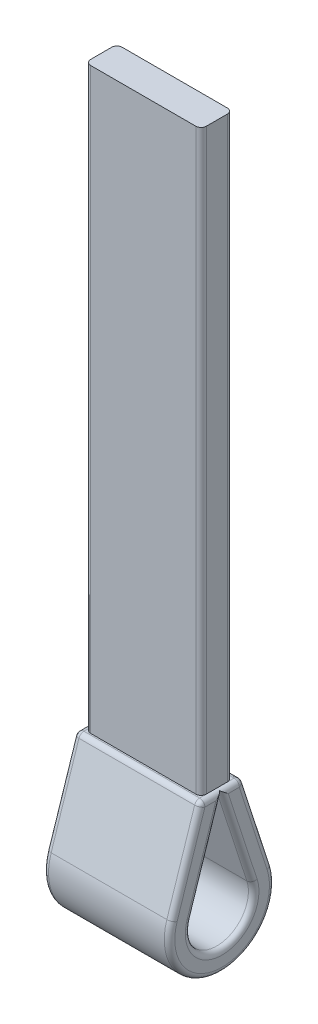
ISO-10303-21;
HEADER;
FILE_DESCRIPTION(('STEP AP214'),'2;1');
FILE_NAME('part.step','',(''),(''),'','','');
FILE_SCHEMA(('AUTOMOTIVE_DESIGN { 1 0 10303 214 1 1 1 1 }'));
ENDSEC;
DATA;
#1=APPLICATION_CONTEXT('core data for automotive mechanical design processes');
#2=APPLICATION_PROTOCOL_DEFINITION('international standard','automotive_design',2000,#1);
#3=PRODUCT_CONTEXT('',#1,'mechanical');
#4=PRODUCT('Part','Part','',(#3));
#5=PRODUCT_RELATED_PRODUCT_CATEGORY('part','',(#4));
#6=PRODUCT_DEFINITION_FORMATION('','',#4);
#7=PRODUCT_DEFINITION_CONTEXT('part definition',#1,'design');
#8=PRODUCT_DEFINITION('design','',#6,#7);
#9=PRODUCT_DEFINITION_SHAPE('','',#8);
#10=(LENGTH_UNIT() NAMED_UNIT(*) SI_UNIT(.MILLI.,.METRE.));
#11=(NAMED_UNIT(*) PLANE_ANGLE_UNIT() SI_UNIT($,.RADIAN.));
#12=(NAMED_UNIT(*) SI_UNIT($,.STERADIAN.) SOLID_ANGLE_UNIT());
#13=UNCERTAINTY_MEASURE_WITH_UNIT(LENGTH_MEASURE(1.E-05),#10,'distance_accuracy_value','');
#14=(GEOMETRIC_REPRESENTATION_CONTEXT(3) GLOBAL_UNCERTAINTY_ASSIGNED_CONTEXT((#13)) GLOBAL_UNIT_ASSIGNED_CONTEXT((#10,
#11,#12)) REPRESENTATION_CONTEXT('',''));
#15=CARTESIAN_POINT('',(0.,0.,0.));
#16=DIRECTION('',(0.,0.,1.));
#17=DIRECTION('',(1.,0.,0.));
#18=AXIS2_PLACEMENT_3D('',#15,#16,#17);
#19=CARTESIAN_POINT('',(0.,20.,0.));
#20=DIRECTION('',(0.,1.,0.));
#21=DIRECTION('',(0.,0.,1.));
#22=AXIS2_PLACEMENT_3D('',#19,#20,#21);
#23=PLANE('',#22);
#24=DIRECTION('',(-1.,0.,0.));
#25=VECTOR('',#24,1.);
#26=CARTESIAN_POINT('',(23.,20.,-3.));
#27=LINE('',#26,#25);
#28=CARTESIAN_POINT('',(22.,20.,-3.));
#29=VERTEX_POINT('',#28);
#30=CARTESIAN_POINT('',(2.,20.,-3.));
#31=VERTEX_POINT('',#30);
#32=EDGE_CURVE('E249',#29,#31,#27,.T.);
#33=ORIENTED_EDGE('',*,*,#32,.F.);
#34=CARTESIAN_POINT('',(22.,20.,-2.));
#35=DIRECTION('',(0.,1.,0.));
#36=DIRECTION('',(0.,0.,1.));
#37=AXIS2_PLACEMENT_3D('',#34,#35,#36);
#38=CIRCLE('',#37,1.);
#39=CARTESIAN_POINT('',(23.,20.,-2.));
#40=VERTEX_POINT('',#39);
#41=EDGE_CURVE('E47',#29,#40,#38,.F.);
#42=ORIENTED_EDGE('',*,*,#41,.T.);
#43=DIRECTION('',(0.,0.,-1.));
#44=VECTOR('',#43,1.);
#45=CARTESIAN_POINT('',(23.,20.,0.));
#46=LINE('',#45,#44);
#47=CARTESIAN_POINT('',(23.,20.,-3.27412037217896));
#48=VERTEX_POINT('',#47);
#49=EDGE_CURVE('E54',#40,#48,#46,.T.);
#50=ORIENTED_EDGE('',*,*,#49,.T.);
#51=DIRECTION('',(-1.,0.,0.));
#52=VECTOR('',#51,1.);
#53=CARTESIAN_POINT('',(0.,20.,-3.27412037217896));
#54=LINE('',#53,#52);
#55=CARTESIAN_POINT('',(1.,20.,-3.27412037217896));
#56=VERTEX_POINT('',#55);
#57=EDGE_CURVE('E343',#48,#56,#54,.T.);
#58=ORIENTED_EDGE('',*,*,#57,.T.);
#59=DIRECTION('',(0.,0.,1.));
#60=VECTOR('',#59,1.);
#61=CARTESIAN_POINT('',(1.,20.,4.));
#62=LINE('',#61,#60);
#63=CARTESIAN_POINT('',(1.,20.,-2.));
#64=VERTEX_POINT('',#63);
#65=EDGE_CURVE('E341',#56,#64,#62,.T.);
#66=ORIENTED_EDGE('',*,*,#65,.T.);
#67=CARTESIAN_POINT('',(2.,20.,-2.));
#68=DIRECTION('',(0.,1.,0.));
#69=DIRECTION('',(0.,0.,1.));
#70=AXIS2_PLACEMENT_3D('',#67,#68,#69);
#71=CIRCLE('',#70,1.);
#72=EDGE_CURVE('E435',#64,#31,#71,.F.);
#73=ORIENTED_EDGE('',*,*,#72,.T.);
#74=EDGE_LOOP('',(#33,#42,#50,#58,#66,#73));
#75=FACE_BOUND('',#74,.T.);
#76=ADVANCED_FACE('F38',(#75),#23,.T.);
#77=CARTESIAN_POINT('',(24.,0.,0.));
#78=DIRECTION('',(1.,0.,0.));
#79=DIRECTION('',(0.,0.,-1.));
#80=AXIS2_PLACEMENT_3D('',#77,#78,#79);
#81=PLANE('',#80);
#82=DIRECTION('',(0.,0.950787924741884,0.309842415051623));
#83=VECTOR('',#82,1.);
#84=CARTESIAN_POINT('',(24.,19.6901575849484,-3.04921207525812));
#85=LINE('',#84,#83);
#86=CARTESIAN_POINT('',(24.,2.78858173546461,-8.55709132267695));
#87=VERTEX_POINT('',#86);
#88=CARTESIAN_POINT('',(24.,19.,-3.27412037217896));
#89=VERTEX_POINT('',#88);
#90=EDGE_CURVE('E288',#87,#89,#85,.T.);
#91=ORIENTED_EDGE('',*,*,#90,.T.);
#92=DIRECTION('',(0.,0.,-1.));
#93=VECTOR('',#92,1.);
#94=CARTESIAN_POINT('',(24.,19.,0.));
#95=LINE('',#94,#93);
#96=CARTESIAN_POINT('',(24.,19.,-1.17060186089481));
#97=VERTEX_POINT('',#96);
#98=EDGE_CURVE('E295',#89,#97,#95,.F.);
#99=ORIENTED_EDGE('',*,*,#98,.T.);
#100=DIRECTION('',(0.,0.950787924741884,0.309842415051623));
#101=VECTOR('',#100,1.);
#102=CARTESIAN_POINT('',(24.,2.16889690536136,-6.65551547319318));
#103=LINE('',#102,#101);
#104=CARTESIAN_POINT('',(24.,2.16889690536136,-6.65551547319319));
#105=VERTEX_POINT('',#104);
#106=EDGE_CURVE('E292',#97,#105,#103,.F.);
#107=ORIENTED_EDGE('',*,*,#106,.T.);
#108=CARTESIAN_POINT('',(24.,0.,0.));
#109=DIRECTION('',(1.,0.,0.));
#110=DIRECTION('',(0.,0.,-1.));
#111=AXIS2_PLACEMENT_3D('',#108,#109,#110);
#112=CIRCLE('',#111,7.);
#113=CARTESIAN_POINT('',(24.,2.16889690536136,6.65551547319318));
#114=VERTEX_POINT('',#113);
#115=EDGE_CURVE('E290',#105,#114,#112,.F.);
#116=ORIENTED_EDGE('',*,*,#115,.T.);
#117=DIRECTION('',(0.,-0.950787924741884,0.309842415051623));
#118=VECTOR('',#117,1.);
#119=CARTESIAN_POINT('',(24.,2.16889690536136,6.65551547319318));
#120=LINE('',#119,#118);
#121=CARTESIAN_POINT('',(24.,19.,1.17060186089481));
#122=VERTEX_POINT('',#121);
#123=EDGE_CURVE('E284',#114,#122,#120,.F.);
#124=ORIENTED_EDGE('',*,*,#123,.T.);
#125=DIRECTION('',(0.,0.,-1.));
#126=VECTOR('',#125,1.);
#127=CARTESIAN_POINT('',(24.,19.,0.));
#128=LINE('',#127,#126);
#129=CARTESIAN_POINT('',(24.,19.,3.27412037217896));
#130=VERTEX_POINT('',#129);
#131=EDGE_CURVE('E282',#122,#130,#128,.F.);
#132=ORIENTED_EDGE('',*,*,#131,.T.);
#133=DIRECTION('',(0.,-0.950787924741884,0.309842415051623));
#134=VECTOR('',#133,1.);
#135=CARTESIAN_POINT('',(24.,2.78858173546461,8.55709132267695));
#136=LINE('',#135,#134);
#137=CARTESIAN_POINT('',(24.,2.78858173546461,8.55709132267695));
#138=VERTEX_POINT('',#137);
#139=EDGE_CURVE('E280',#130,#138,#136,.T.);
#140=ORIENTED_EDGE('',*,*,#139,.T.);
#141=CARTESIAN_POINT('',(24.,0.,0.));
#142=DIRECTION('',(1.,0.,0.));
#143=DIRECTION('',(0.,0.,-1.));
#144=AXIS2_PLACEMENT_3D('',#141,#142,#143);
#145=CIRCLE('',#144,9.);
#146=EDGE_CURVE('E286',#138,#87,#145,.T.);
#147=ORIENTED_EDGE('',*,*,#146,.T.);
#148=EDGE_LOOP('',(#91,#99,#107,#116,#124,#132,#140,#147));
#149=FACE_BOUND('',#148,.T.);
#150=ADVANCED_FACE('F489',(#149),#81,.T.);
#151=CARTESIAN_POINT('',(0.,0.,0.));
#152=DIRECTION('',(1.,0.,0.));
#153=DIRECTION('',(0.,0.,-1.));
#154=AXIS2_PLACEMENT_3D('',#151,#152,#153);
#155=PLANE('',#154);
#156=DIRECTION('',(0.,-0.950787924741884,0.309842415051623));
#157=VECTOR('',#156,1.);
#158=CARTESIAN_POINT('',(0.,2.16889690536136,6.65551547319318));
#159=LINE('',#158,#157);
#160=CARTESIAN_POINT('',(0.,19.,1.17060186089481));
#161=VERTEX_POINT('',#160);
#162=CARTESIAN_POINT('',(0.,2.16889690536136,6.65551547319318));
#163=VERTEX_POINT('',#162);
#164=EDGE_CURVE('E320',#161,#163,#159,.T.);
#165=ORIENTED_EDGE('',*,*,#164,.T.);
#166=CARTESIAN_POINT('',(0.,0.,0.));
#167=DIRECTION('',(1.,0.,0.));
#168=DIRECTION('',(0.,0.,-1.));
#169=AXIS2_PLACEMENT_3D('',#166,#167,#168);
#170=CIRCLE('',#169,7.);
#171=CARTESIAN_POINT('',(0.,2.16889690536136,-6.65551547319318));
#172=VERTEX_POINT('',#171);
#173=EDGE_CURVE('E327',#163,#172,#170,.T.);
#174=ORIENTED_EDGE('',*,*,#173,.T.);
#175=DIRECTION('',(0.,0.950787924741884,0.309842415051623));
#176=VECTOR('',#175,1.);
#177=CARTESIAN_POINT('',(0.,19.674524939232,-0.950787924741884));
#178=LINE('',#177,#176);
#179=CARTESIAN_POINT('',(0.,19.,-1.17060186089481));
#180=VERTEX_POINT('',#179);
#181=EDGE_CURVE('E325',#172,#180,#178,.T.);
#182=ORIENTED_EDGE('',*,*,#181,.T.);
#183=DIRECTION('',(0.,0.,1.));
#184=VECTOR('',#183,1.);
#185=CARTESIAN_POINT('',(0.,19.,-4.));
#186=LINE('',#185,#184);
#187=CARTESIAN_POINT('',(0.,19.,-3.27412037217896));
#188=VERTEX_POINT('',#187);
#189=EDGE_CURVE('E323',#180,#188,#186,.F.);
#190=ORIENTED_EDGE('',*,*,#189,.T.);
#191=DIRECTION('',(0.,0.950787924741884,0.309842415051623));
#192=VECTOR('',#191,1.);
#193=CARTESIAN_POINT('',(0.,2.78858173546461,-8.55709132267695));
#194=LINE('',#193,#192);
#195=CARTESIAN_POINT('',(0.,2.78858173546461,-8.55709132267695));
#196=VERTEX_POINT('',#195);
#197=EDGE_CURVE('E318',#188,#196,#194,.F.);
#198=ORIENTED_EDGE('',*,*,#197,.T.);
#199=CARTESIAN_POINT('',(0.,0.,0.));
#200=DIRECTION('',(1.,0.,0.));
#201=DIRECTION('',(0.,0.,-1.));
#202=AXIS2_PLACEMENT_3D('',#199,#200,#201);
#203=CIRCLE('',#202,9.);
#204=CARTESIAN_POINT('',(0.,2.78858173546461,8.55709132267695));
#205=VERTEX_POINT('',#204);
#206=EDGE_CURVE('E316',#196,#205,#203,.F.);
#207=ORIENTED_EDGE('',*,*,#206,.T.);
#208=DIRECTION('',(0.,-0.950787924741884,0.309842415051623));
#209=VECTOR('',#208,1.);
#210=CARTESIAN_POINT('',(0.,2.78858173546461,8.55709132267695));
#211=LINE('',#210,#209);
#212=CARTESIAN_POINT('',(0.,19.,3.27412037217896));
#213=VERTEX_POINT('',#212);
#214=EDGE_CURVE('E312',#205,#213,#211,.F.);
#215=ORIENTED_EDGE('',*,*,#214,.T.);
#216=DIRECTION('',(0.,0.,1.));
#217=VECTOR('',#216,1.);
#218=CARTESIAN_POINT('',(0.,19.,-4.));
#219=LINE('',#218,#217);
#220=EDGE_CURVE('E314',#213,#161,#219,.F.);
#221=ORIENTED_EDGE('',*,*,#220,.T.);
#222=EDGE_LOOP('',(#165,#174,#182,#190,#198,#207,#215,#221));
#223=FACE_BOUND('',#222,.T.);
#224=ADVANCED_FACE('F550',(#223),#155,.F.);
#225=CARTESIAN_POINT('',(24.,0.,0.));
#226=DIRECTION('',(-1.,0.,0.));
#227=DIRECTION('',(0.,0.,1.));
#228=AXIS2_PLACEMENT_3D('',#225,#226,#227);
#229=CYLINDRICAL_SURFACE('',#228,10.);
#230=DIRECTION('',(-1.,0.,0.));
#231=VECTOR('',#230,1.);
#232=CARTESIAN_POINT('',(24.,3.09842415051623,-9.50787924741883));
#233=LINE('',#232,#231);
#234=CARTESIAN_POINT('',(23.,3.09842415051623,-9.50787924741883));
#235=VERTEX_POINT('',#234);
#236=CARTESIAN_POINT('',(1.,3.09842415051623,-9.50787924741883));
#237=VERTEX_POINT('',#236);
#238=EDGE_CURVE('E272',#235,#237,#233,.T.);
#239=ORIENTED_EDGE('',*,*,#238,.F.);
#240=CARTESIAN_POINT('',(23.,0.,0.));
#241=DIRECTION('',(1.,0.,0.));
#242=DIRECTION('',(0.,0.,-1.));
#243=AXIS2_PLACEMENT_3D('',#240,#241,#242);
#244=CIRCLE('',#243,10.);
#245=CARTESIAN_POINT('',(23.,3.09842415051623,9.50787924741883));
#246=VERTEX_POINT('',#245);
#247=EDGE_CURVE('E310',#235,#246,#244,.F.);
#248=ORIENTED_EDGE('',*,*,#247,.T.);
#249=DIRECTION('',(-1.,0.,0.));
#250=VECTOR('',#249,1.);
#251=CARTESIAN_POINT('',(24.,3.09842415051623,9.50787924741883));
#252=LINE('',#251,#250);
#253=CARTESIAN_POINT('',(1.,3.09842415051623,9.50787924741883));
#254=VERTEX_POINT('',#253);
#255=EDGE_CURVE('E269',#246,#254,#252,.T.);
#256=ORIENTED_EDGE('',*,*,#255,.T.);
#257=CARTESIAN_POINT('',(1.,0.,0.));
#258=DIRECTION('',(1.,0.,0.));
#259=DIRECTION('',(0.,0.,-1.));
#260=AXIS2_PLACEMENT_3D('',#257,#258,#259);
#261=CIRCLE('',#260,10.);
#262=EDGE_CURVE('E308',#254,#237,#261,.T.);
#263=ORIENTED_EDGE('',*,*,#262,.T.);
#264=EDGE_LOOP('',(#239,#248,#256,#263));
#265=FACE_BOUND('',#264,.T.);
#266=ADVANCED_FACE('F573',(#265),#229,.T.);
#267=CARTESIAN_POINT('',(24.,20.,-4.));
#268=DIRECTION('',(0.,-0.309842415051623,0.950787924741884));
#269=DIRECTION('',(0.,-0.950787924741884,-0.309842415051623));
#270=AXIS2_PLACEMENT_3D('',#267,#268,#269);
#271=PLANE('',#270);
#272=DIRECTION('',(-1.,0.,0.));
#273=VECTOR('',#272,1.);
#274=CARTESIAN_POINT('',(24.,19.3098424150516,-4.22490829692085));
#275=LINE('',#274,#273);
#276=CARTESIAN_POINT('',(1.,19.3098424150516,-4.22490829692085));
#277=VERTEX_POINT('',#276);
#278=CARTESIAN_POINT('',(23.,19.3098424150516,-4.22490829692085));
#279=VERTEX_POINT('',#278);
#280=EDGE_CURVE('E301',#277,#279,#275,.F.);
#281=ORIENTED_EDGE('',*,*,#280,.T.);
#282=DIRECTION('',(0.,0.950787924741884,0.309842415051623));
#283=VECTOR('',#282,1.);
#284=CARTESIAN_POINT('',(23.,3.09842415051623,-9.50787924741883));
#285=LINE('',#284,#283);
#286=EDGE_CURVE('E305',#279,#235,#285,.F.);
#287=ORIENTED_EDGE('',*,*,#286,.T.);
#288=ORIENTED_EDGE('',*,*,#238,.T.);
#289=DIRECTION('',(0.,0.950787924741884,0.309842415051623));
#290=VECTOR('',#289,1.);
#291=CARTESIAN_POINT('',(1.,20.,-4.));
#292=LINE('',#291,#290);
#293=EDGE_CURVE('E303',#237,#277,#292,.T.);
#294=ORIENTED_EDGE('',*,*,#293,.T.);
#295=EDGE_LOOP('',(#281,#287,#288,#294));
#296=FACE_BOUND('',#295,.T.);
#297=ADVANCED_FACE('F575',(#296),#271,.F.);
#298=CARTESIAN_POINT('',(24.,3.09842415051623,9.50787924741883));
#299=DIRECTION('',(0.,-0.309842415051623,-0.950787924741884));
#300=DIRECTION('',(0.,0.950787924741884,-0.309842415051623));
#301=AXIS2_PLACEMENT_3D('',#298,#299,#300);
#302=PLANE('',#301);
#303=ORIENTED_EDGE('',*,*,#255,.F.);
#304=DIRECTION('',(0.,-0.950787924741884,0.309842415051623));
#305=VECTOR('',#304,1.);
#306=CARTESIAN_POINT('',(23.,20.,4.));
#307=LINE('',#306,#305);
#308=CARTESIAN_POINT('',(23.,19.3098424150516,4.22490829692084));
#309=VERTEX_POINT('',#308);
#310=EDGE_CURVE('E217',#246,#309,#307,.F.);
#311=ORIENTED_EDGE('',*,*,#310,.T.);
#312=DIRECTION('',(-1.,0.,0.));
#313=VECTOR('',#312,1.);
#314=CARTESIAN_POINT('',(0.,19.3098424150516,4.22490829692084));
#315=LINE('',#314,#313);
#316=CARTESIAN_POINT('',(1.,19.3098424150516,4.22490829692084));
#317=VERTEX_POINT('',#316);
#318=EDGE_CURVE('E348',#309,#317,#315,.T.);
#319=ORIENTED_EDGE('',*,*,#318,.T.);
#320=DIRECTION('',(0.,-0.950787924741884,0.309842415051623));
#321=VECTOR('',#320,1.);
#322=CARTESIAN_POINT('',(1.,3.09842415051623,9.50787924741883));
#323=LINE('',#322,#321);
#324=EDGE_CURVE('E346',#317,#254,#323,.T.);
#325=ORIENTED_EDGE('',*,*,#324,.T.);
#326=EDGE_LOOP('',(#303,#311,#319,#325));
#327=FACE_BOUND('',#326,.T.);
#328=ADVANCED_FACE('F570',(#327),#302,.F.);
#329=CARTESIAN_POINT('',(24.,0.,0.));
#330=DIRECTION('',(-1.,0.,0.));
#331=DIRECTION('',(0.,0.,1.));
#332=AXIS2_PLACEMENT_3D('',#329,#330,#331);
#333=CYLINDRICAL_SURFACE('',#332,6.);
#334=DIRECTION('',(-1.,0.,0.));
#335=VECTOR('',#334,1.);
#336=CARTESIAN_POINT('',(24.,1.85905449030974,5.7047275484513));
#337=LINE('',#336,#335);
#338=CARTESIAN_POINT('',(23.,1.85905449030974,5.7047275484513));
#339=VERTEX_POINT('',#338);
#340=CARTESIAN_POINT('',(1.,1.85905449030974,5.7047275484513));
#341=VERTEX_POINT('',#340);
#342=EDGE_CURVE('E260',#339,#341,#337,.T.);
#343=ORIENTED_EDGE('',*,*,#342,.F.);
#344=CARTESIAN_POINT('',(23.,0.,0.));
#345=DIRECTION('',(1.,0.,0.));
#346=DIRECTION('',(0.,0.,-1.));
#347=AXIS2_PLACEMENT_3D('',#344,#345,#346);
#348=CIRCLE('',#347,6.);
#349=CARTESIAN_POINT('',(23.,1.85905449030974,-5.7047275484513));
#350=VERTEX_POINT('',#349);
#351=EDGE_CURVE('E299',#339,#350,#348,.T.);
#352=ORIENTED_EDGE('',*,*,#351,.T.);
#353=DIRECTION('',(-1.,0.,0.));
#354=VECTOR('',#353,1.);
#355=CARTESIAN_POINT('',(24.,1.85905449030974,-5.7047275484513));
#356=LINE('',#355,#354);
#357=CARTESIAN_POINT('',(1.,1.85905449030974,-5.7047275484513));
#358=VERTEX_POINT('',#357);
#359=EDGE_CURVE('E266',#350,#358,#356,.T.);
#360=ORIENTED_EDGE('',*,*,#359,.T.);
#361=CARTESIAN_POINT('',(1.,0.,0.));
#362=DIRECTION('',(1.,0.,0.));
#363=DIRECTION('',(0.,0.,-1.));
#364=AXIS2_PLACEMENT_3D('',#361,#362,#363);
#365=CIRCLE('',#364,6.);
#366=EDGE_CURVE('E297',#358,#341,#365,.F.);
#367=ORIENTED_EDGE('',*,*,#366,.T.);
#368=EDGE_LOOP('',(#343,#352,#360,#367));
#369=FACE_BOUND('',#368,.T.);
#370=ADVANCED_FACE('F546',(#369),#333,.F.);
#371=CARTESIAN_POINT('',(24.,19.3646825241803,0.));
#372=DIRECTION('',(0.,-0.309842415051623,0.950787924741883));
#373=DIRECTION('',(0.,-0.950787924741884,-0.309842415051623));
#374=AXIS2_PLACEMENT_3D('',#371,#372,#373);
#375=PLANE('',#374);
#376=ORIENTED_EDGE('',*,*,#359,.F.);
#377=DIRECTION('',(0.,0.950787924741884,0.309842415051623));
#378=VECTOR('',#377,1.);
#379=CARTESIAN_POINT('',(23.,19.3646825241803,0.));
#380=LINE('',#379,#378);
#381=CARTESIAN_POINT('',(23.,19.3646825241803,0.));
#382=VERTEX_POINT('',#381);
#383=EDGE_CURVE('E277',#350,#382,#380,.T.);
#384=ORIENTED_EDGE('',*,*,#383,.T.);
#385=DIRECTION('',(-1.,0.,0.));
#386=VECTOR('',#385,1.);
#387=CARTESIAN_POINT('',(24.,19.3646825241803,0.));
#388=LINE('',#387,#386);
#389=CARTESIAN_POINT('',(1.,19.3646825241803,0.));
#390=VERTEX_POINT('',#389);
#391=EDGE_CURVE('E263',#382,#390,#388,.T.);
#392=ORIENTED_EDGE('',*,*,#391,.T.);
#393=DIRECTION('',(0.,0.950787924741884,0.309842415051623));
#394=VECTOR('',#393,1.);
#395=CARTESIAN_POINT('',(1.,1.85905449030974,-5.7047275484513));
#396=LINE('',#395,#394);
#397=EDGE_CURVE('E275',#390,#358,#396,.F.);
#398=ORIENTED_EDGE('',*,*,#397,.T.);
#399=EDGE_LOOP('',(#376,#384,#392,#398));
#400=FACE_BOUND('',#399,.T.);
#401=ADVANCED_FACE('F528',(#400),#375,.T.);
#402=CARTESIAN_POINT('',(24.,1.85905449030974,5.7047275484513));
#403=DIRECTION('',(0.,-0.309842415051623,-0.950787924741883));
#404=DIRECTION('',(0.,0.950787924741884,-0.309842415051623));
#405=AXIS2_PLACEMENT_3D('',#402,#403,#404);
#406=PLANE('',#405);
#407=ORIENTED_EDGE('',*,*,#342,.T.);
#408=DIRECTION('',(0.,-0.950787924741884,0.309842415051623));
#409=VECTOR('',#408,1.);
#410=CARTESIAN_POINT('',(1.,19.3646825241803,0.));
#411=LINE('',#410,#409);
#412=EDGE_CURVE('E331',#341,#390,#411,.F.);
#413=ORIENTED_EDGE('',*,*,#412,.T.);
#414=ORIENTED_EDGE('',*,*,#391,.F.);
#415=DIRECTION('',(0.,-0.950787924741884,0.309842415051623));
#416=VECTOR('',#415,1.);
#417=CARTESIAN_POINT('',(23.,1.85905449030974,5.7047275484513));
#418=LINE('',#417,#416);
#419=EDGE_CURVE('E329',#382,#339,#418,.T.);
#420=ORIENTED_EDGE('',*,*,#419,.T.);
#421=EDGE_LOOP('',(#407,#413,#414,#420));
#422=FACE_BOUND('',#421,.T.);
#423=ADVANCED_FACE('F529',(#422),#406,.T.);
#424=DIRECTION('',(-1.,0.,0.));
#425=VECTOR('',#424,1.);
#426=CARTESIAN_POINT('',(24.,20.,3.27412037217896));
#427=LINE('',#426,#425);
#428=CARTESIAN_POINT('',(1.,20.,3.27412037217896));
#429=VERTEX_POINT('',#428);
#430=CARTESIAN_POINT('',(23.,20.,3.27412037217896));
#431=VERTEX_POINT('',#430);
#432=EDGE_CURVE('E336',#429,#431,#427,.F.);
#433=ORIENTED_EDGE('',*,*,#432,.T.);
#434=DIRECTION('',(0.,0.,-1.));
#435=VECTOR('',#434,1.);
#436=CARTESIAN_POINT('',(23.,20.,0.));
#437=LINE('',#436,#435);
#438=CARTESIAN_POINT('',(23.,20.,2.));
#439=VERTEX_POINT('',#438);
#440=EDGE_CURVE('E338',#431,#439,#437,.T.);
#441=ORIENTED_EDGE('',*,*,#440,.T.);
#442=CARTESIAN_POINT('',(22.,20.,2.));
#443=DIRECTION('',(0.,1.,0.));
#444=DIRECTION('',(0.,0.,1.));
#445=AXIS2_PLACEMENT_3D('',#442,#443,#444);
#446=CIRCLE('',#445,1.);
#447=CARTESIAN_POINT('',(22.,20.,3.));
#448=VERTEX_POINT('',#447);
#449=EDGE_CURVE('E11',#439,#448,#446,.F.);
#450=ORIENTED_EDGE('',*,*,#449,.T.);
#451=DIRECTION('',(1.,0.,0.));
#452=VECTOR('',#451,1.);
#453=CARTESIAN_POINT('',(1.,20.,3.));
#454=LINE('',#453,#452);
#455=CARTESIAN_POINT('',(2.,20.,3.));
#456=VERTEX_POINT('',#455);
#457=EDGE_CURVE('E255',#456,#448,#454,.T.);
#458=ORIENTED_EDGE('',*,*,#457,.F.);
#459=CARTESIAN_POINT('',(2.,20.,2.));
#460=DIRECTION('',(0.,1.,0.));
#461=DIRECTION('',(0.,0.,1.));
#462=AXIS2_PLACEMENT_3D('',#459,#460,#461);
#463=CIRCLE('',#462,1.);
#464=CARTESIAN_POINT('',(1.,20.,2.));
#465=VERTEX_POINT('',#464);
#466=EDGE_CURVE('E437',#456,#465,#463,.F.);
#467=ORIENTED_EDGE('',*,*,#466,.T.);
#468=DIRECTION('',(0.,0.,1.));
#469=VECTOR('',#468,1.);
#470=CARTESIAN_POINT('',(1.,20.,4.));
#471=LINE('',#470,#469);
#472=EDGE_CURVE('E334',#465,#429,#471,.T.);
#473=ORIENTED_EDGE('',*,*,#472,.T.);
#474=EDGE_LOOP('',(#433,#441,#450,#458,#467,#473));
#475=FACE_BOUND('',#474,.T.);
#476=ADVANCED_FACE('F452',(#475),#23,.T.);
#477=CARTESIAN_POINT('',(23.,20.,-3.));
#478=DIRECTION('',(0.,0.,-1.));
#479=DIRECTION('',(-1.,0.,0.));
#480=AXIS2_PLACEMENT_3D('',#477,#478,#479);
#481=PLANE('',#480);
#482=ORIENTED_EDGE('',*,*,#32,.T.);
#483=DIRECTION('',(0.,1.,0.));
#484=VECTOR('',#483,1.);
#485=CARTESIAN_POINT('',(2.,20.,-3.));
#486=LINE('',#485,#484);
#487=CARTESIAN_POINT('',(2.,130.,-3.));
#488=VERTEX_POINT('',#487);
#489=EDGE_CURVE('E216',#31,#488,#486,.T.);
#490=ORIENTED_EDGE('',*,*,#489,.T.);
#491=DIRECTION('',(-1.,0.,0.));
#492=VECTOR('',#491,1.);
#493=CARTESIAN_POINT('',(22.,130.,-3.));
#494=LINE('',#493,#492);
#495=CARTESIAN_POINT('',(22.,130.,-3.));
#496=VERTEX_POINT('',#495);
#497=EDGE_CURVE('E220',#496,#488,#494,.T.);
#498=ORIENTED_EDGE('',*,*,#497,.F.);
#499=DIRECTION('',(0.,1.,0.));
#500=VECTOR('',#499,1.);
#501=CARTESIAN_POINT('',(22.,20.,-3.));
#502=LINE('',#501,#500);
#503=EDGE_CURVE('E206',#496,#29,#502,.F.);
#504=ORIENTED_EDGE('',*,*,#503,.T.);
#505=EDGE_LOOP('',(#482,#490,#498,#504));
#506=FACE_BOUND('',#505,.T.);
#507=ADVANCED_FACE('F221',(#506),#481,.T.);
#508=CARTESIAN_POINT('',(23.,20.,3.));
#509=DIRECTION('',(1.,0.,0.));
#510=DIRECTION('',(0.,0.,-1.));
#511=AXIS2_PLACEMENT_3D('',#508,#509,#510);
#512=PLANE('',#511);
#513=DIRECTION('',(0.,0.,-1.));
#514=VECTOR('',#513,1.);
#515=CARTESIAN_POINT('',(23.,20.,3.));
#516=LINE('',#515,#514);
#517=EDGE_CURVE('E258',#439,#40,#516,.T.);
#518=ORIENTED_EDGE('',*,*,#517,.T.);
#519=DIRECTION('',(0.,1.,0.));
#520=VECTOR('',#519,1.);
#521=CARTESIAN_POINT('',(23.,20.,-2.));
#522=LINE('',#521,#520);
#523=CARTESIAN_POINT('',(23.,130.,-2.));
#524=VERTEX_POINT('',#523);
#525=EDGE_CURVE('E433',#40,#524,#522,.T.);
#526=ORIENTED_EDGE('',*,*,#525,.T.);
#527=DIRECTION('',(0.,0.,-1.));
#528=VECTOR('',#527,1.);
#529=CARTESIAN_POINT('',(23.,130.,2.));
#530=LINE('',#529,#528);
#531=CARTESIAN_POINT('',(23.,130.,2.));
#532=VERTEX_POINT('',#531);
#533=EDGE_CURVE('E232',#532,#524,#530,.T.);
#534=ORIENTED_EDGE('',*,*,#533,.F.);
#535=DIRECTION('',(0.,1.,0.));
#536=VECTOR('',#535,1.);
#537=CARTESIAN_POINT('',(23.,20.,2.));
#538=LINE('',#537,#536);
#539=EDGE_CURVE('E430',#532,#439,#538,.F.);
#540=ORIENTED_EDGE('',*,*,#539,.T.);
#541=EDGE_LOOP('',(#518,#526,#534,#540));
#542=FACE_BOUND('',#541,.T.);
#543=ADVANCED_FACE('F442',(#542),#512,.T.);
#544=CARTESIAN_POINT('',(1.,20.,3.));
#545=DIRECTION('',(0.,0.,1.));
#546=DIRECTION('',(1.,0.,0.));
#547=AXIS2_PLACEMENT_3D('',#544,#545,#546);
#548=PLANE('',#547);
#549=DIRECTION('',(0.,1.,0.));
#550=VECTOR('',#549,1.);
#551=CARTESIAN_POINT('',(22.,20.,3.));
#552=LINE('',#551,#550);
#553=CARTESIAN_POINT('',(22.,130.,3.));
#554=VERTEX_POINT('',#553);
#555=EDGE_CURVE('E426',#448,#554,#552,.T.);
#556=ORIENTED_EDGE('',*,*,#555,.T.);
#557=DIRECTION('',(1.,0.,0.));
#558=VECTOR('',#557,1.);
#559=CARTESIAN_POINT('',(2.,130.,3.));
#560=LINE('',#559,#558);
#561=CARTESIAN_POINT('',(2.,130.,3.));
#562=VERTEX_POINT('',#561);
#563=EDGE_CURVE('E242',#562,#554,#560,.T.);
#564=ORIENTED_EDGE('',*,*,#563,.F.);
#565=DIRECTION('',(0.,1.,0.));
#566=VECTOR('',#565,1.);
#567=CARTESIAN_POINT('',(2.,20.,3.));
#568=LINE('',#567,#566);
#569=EDGE_CURVE('E428',#562,#456,#568,.F.);
#570=ORIENTED_EDGE('',*,*,#569,.T.);
#571=ORIENTED_EDGE('',*,*,#457,.T.);
#572=EDGE_LOOP('',(#556,#564,#570,#571));
#573=FACE_BOUND('',#572,.T.);
#574=ADVANCED_FACE('F455',(#573),#548,.T.);
#575=CARTESIAN_POINT('',(1.,20.,-3.));
#576=DIRECTION('',(-1.,0.,0.));
#577=DIRECTION('',(0.,0.,1.));
#578=AXIS2_PLACEMENT_3D('',#575,#576,#577);
#579=PLANE('',#578);
#580=DIRECTION('',(0.,1.,0.));
#581=VECTOR('',#580,1.);
#582=CARTESIAN_POINT('',(1.,20.,2.));
#583=LINE('',#582,#581);
#584=CARTESIAN_POINT('',(1.,130.,2.));
#585=VERTEX_POINT('',#584);
#586=EDGE_CURVE('E421',#465,#585,#583,.T.);
#587=ORIENTED_EDGE('',*,*,#586,.T.);
#588=DIRECTION('',(0.,0.,1.));
#589=VECTOR('',#588,1.);
#590=CARTESIAN_POINT('',(1.,130.,-2.));
#591=LINE('',#590,#589);
#592=CARTESIAN_POINT('',(1.,130.,-2.));
#593=VERTEX_POINT('',#592);
#594=EDGE_CURVE('E236',#593,#585,#591,.T.);
#595=ORIENTED_EDGE('',*,*,#594,.F.);
#596=DIRECTION('',(0.,1.,0.));
#597=VECTOR('',#596,1.);
#598=CARTESIAN_POINT('',(1.,20.,-2.));
#599=LINE('',#598,#597);
#600=EDGE_CURVE('E423',#593,#64,#599,.F.);
#601=ORIENTED_EDGE('',*,*,#600,.T.);
#602=DIRECTION('',(0.,0.,1.));
#603=VECTOR('',#602,1.);
#604=CARTESIAN_POINT('',(1.,20.,-3.));
#605=LINE('',#604,#603);
#606=EDGE_CURVE('E251',#64,#465,#605,.T.);
#607=ORIENTED_EDGE('',*,*,#606,.T.);
#608=EDGE_LOOP('',(#587,#595,#601,#607));
#609=FACE_BOUND('',#608,.T.);
#610=ADVANCED_FACE('F463',(#609),#579,.T.);
#611=CARTESIAN_POINT('',(1.,0.,0.));
#612=DIRECTION('',(1.,0.,0.));
#613=DIRECTION('',(0.,0.,-1.));
#614=AXIS2_PLACEMENT_3D('',#611,#612,#613);
#615=TOROIDAL_SURFACE('',#614,7.,1.);
#616=CARTESIAN_POINT('',(1.,2.16889690536136,-6.65551547319319));
#617=DIRECTION('',(0.,0.950787924741884,0.309842415051623));
#618=DIRECTION('',(0.,-0.309842415051623,0.950787924741884));
#619=AXIS2_PLACEMENT_3D('',#616,#617,#618);
#620=CIRCLE('',#619,1.);
#621=EDGE_CURVE('E414',#172,#358,#620,.T.);
#622=ORIENTED_EDGE('',*,*,#621,.F.);
#623=ORIENTED_EDGE('',*,*,#173,.F.);
#624=CARTESIAN_POINT('',(1.,2.16889690536136,6.65551547319318));
#625=DIRECTION('',(0.,0.950787924741884,-0.309842415051623));
#626=DIRECTION('',(0.,0.309842415051623,0.950787924741884));
#627=AXIS2_PLACEMENT_3D('',#624,#625,#626);
#628=CIRCLE('',#627,1.);
#629=EDGE_CURVE('E252',#341,#163,#628,.T.);
#630=ORIENTED_EDGE('',*,*,#629,.F.);
#631=ORIENTED_EDGE('',*,*,#366,.F.);
#632=EDGE_LOOP('',(#622,#623,#630,#631));
#633=FACE_BOUND('',#632,.T.);
#634=ADVANCED_FACE('F548',(#633),#615,.T.);
#635=CARTESIAN_POINT('',(1.,2.16889690536136,6.65551547319318));
#636=DIRECTION('',(0.,0.950787924741884,-0.309842415051623));
#637=DIRECTION('',(0.,0.309842415051623,0.950787924741884));
#638=AXIS2_PLACEMENT_3D('',#635,#636,#637);
#639=CYLINDRICAL_SURFACE('',#638,1.);
#640=CARTESIAN_POINT('',(1.,22.5921296115437,0.));
#641=DIRECTION('',(0.,0.,-1.));
#642=DIRECTION('',(0.,1.,0.));
#643=AXIS2_PLACEMENT_3D('',#640,#641,#642);
#644=ELLIPSE('',#643,3.22744708736339,1.);
#645=CARTESIAN_POINT('',(0.472759403994257,19.8497160431129,0.));
#646=VERTEX_POINT('',#645);
#647=EDGE_CURVE('E417',#390,#646,#644,.T.);
#648=ORIENTED_EDGE('',*,*,#647,.F.);
#649=ORIENTED_EDGE('',*,*,#412,.F.);
#650=ORIENTED_EDGE('',*,*,#629,.T.);
#651=ORIENTED_EDGE('',*,*,#164,.F.);
#652=CARTESIAN_POINT('',(1.,19.,1.17060186089481));
#653=DIRECTION('',(0.,0.809272023194804,0.587434075002624));
#654=DIRECTION('',(0.,0.587434075002624,-0.809272023194804));
#655=AXIS2_PLACEMENT_3D('',#652,#653,#654);
#656=ELLIPSE('',#655,1.70231868145465,1.);
#657=EDGE_CURVE('E408',#646,#161,#656,.T.);
#658=ORIENTED_EDGE('',*,*,#657,.F.);
#659=EDGE_LOOP('',(#648,#649,#650,#651,#658));
#660=FACE_BOUND('',#659,.T.);
#661=ADVANCED_FACE('F534',(#660),#639,.T.);
#662=CARTESIAN_POINT('',(1.,2.16889690536136,-6.65551547319318));
#663=DIRECTION('',(0.,-0.950787924741884,-0.309842415051623));
#664=DIRECTION('',(0.,0.309842415051623,-0.950787924741884));
#665=AXIS2_PLACEMENT_3D('',#662,#663,#664);
#666=CYLINDRICAL_SURFACE('',#665,1.);
#667=ORIENTED_EDGE('',*,*,#397,.F.);
#668=ORIENTED_EDGE('',*,*,#647,.T.);
#669=CARTESIAN_POINT('',(1.,19.,-1.17060186089481));
#670=DIRECTION('',(0.,-0.809272023194804,0.587434075002624));
#671=DIRECTION('',(0.,-0.587434075002624,-0.809272023194804));
#672=AXIS2_PLACEMENT_3D('',#669,#670,#671);
#673=ELLIPSE('',#672,1.70231868145465,1.);
#674=EDGE_CURVE('E405',#180,#646,#673,.F.);
#675=ORIENTED_EDGE('',*,*,#674,.F.);
#676=ORIENTED_EDGE('',*,*,#181,.F.);
#677=ORIENTED_EDGE('',*,*,#621,.T.);
#678=EDGE_LOOP('',(#667,#668,#675,#676,#677));
#679=FACE_BOUND('',#678,.T.);
#680=ADVANCED_FACE('F540',(#679),#666,.T.);
#681=CARTESIAN_POINT('',(1.,0.,0.));
#682=DIRECTION('',(1.,0.,0.));
#683=DIRECTION('',(0.,0.,-1.));
#684=AXIS2_PLACEMENT_3D('',#681,#682,#683);
#685=TOROIDAL_SURFACE('',#684,9.,1.);
#686=CARTESIAN_POINT('',(1.,2.78858173546461,-8.55709132267695));
#687=DIRECTION('',(0.,0.950787924741884,0.309842415051623));
#688=DIRECTION('',(0.,-0.309842415051623,0.950787924741884));
#689=AXIS2_PLACEMENT_3D('',#686,#687,#688);
#690=CIRCLE('',#689,1.);
#691=EDGE_CURVE('E402',#237,#196,#690,.T.);
#692=ORIENTED_EDGE('',*,*,#691,.F.);
#693=ORIENTED_EDGE('',*,*,#262,.F.);
#694=CARTESIAN_POINT('',(1.,2.78858173546461,8.55709132267695));
#695=DIRECTION('',(0.,0.950787924741884,-0.309842415051623));
#696=DIRECTION('',(0.,0.309842415051623,0.950787924741884));
#697=AXIS2_PLACEMENT_3D('',#694,#695,#696);
#698=CIRCLE('',#697,1.);
#699=EDGE_CURVE('E411',#205,#254,#698,.T.);
#700=ORIENTED_EDGE('',*,*,#699,.F.);
#701=ORIENTED_EDGE('',*,*,#206,.F.);
#702=EDGE_LOOP('',(#692,#693,#700,#701));
#703=FACE_BOUND('',#702,.T.);
#704=ADVANCED_FACE('F562',(#703),#685,.T.);
#705=CARTESIAN_POINT('',(1.,2.78858173546461,8.55709132267695));
#706=DIRECTION('',(0.,-0.950787924741884,0.309842415051623));
#707=DIRECTION('',(0.,-0.309842415051623,-0.950787924741884));
#708=AXIS2_PLACEMENT_3D('',#705,#706,#707);
#709=CYLINDRICAL_SURFACE('',#708,1.);
#710=ORIENTED_EDGE('',*,*,#699,.T.);
#711=ORIENTED_EDGE('',*,*,#324,.F.);
#712=CARTESIAN_POINT('',(1.,19.,3.27412037217896));
#713=DIRECTION('',(0.,0.950787924741884,-0.309842415051622));
#714=DIRECTION('',(0.,0.309842415051622,0.950787924741884));
#715=AXIS2_PLACEMENT_3D('',#712,#713,#714);
#716=CIRCLE('',#715,1.);
#717=EDGE_CURVE('E399',#213,#317,#716,.T.);
#718=ORIENTED_EDGE('',*,*,#717,.F.);
#719=ORIENTED_EDGE('',*,*,#214,.F.);
#720=EDGE_LOOP('',(#710,#711,#718,#719));
#721=FACE_BOUND('',#720,.T.);
#722=ADVANCED_FACE('F566',(#721),#709,.T.);
#723=CARTESIAN_POINT('',(1.,19.,0.));
#724=DIRECTION('',(0.,0.,-1.));
#725=DIRECTION('',(-1.,0.,0.));
#726=AXIS2_PLACEMENT_3D('',#723,#724,#725);
#727=CYLINDRICAL_SURFACE('',#726,1.);
#728=ORIENTED_EDGE('',*,*,#657,.T.);
#729=ORIENTED_EDGE('',*,*,#220,.F.);
#730=CARTESIAN_POINT('',(1.,19.,3.27412037217896));
#731=DIRECTION('',(0.,0.,1.));
#732=DIRECTION('',(1.,0.,0.));
#733=AXIS2_PLACEMENT_3D('',#730,#731,#732);
#734=CIRCLE('',#733,1.);
#735=EDGE_CURVE('E396',#429,#213,#734,.T.);
#736=ORIENTED_EDGE('',*,*,#735,.F.);
#737=ORIENTED_EDGE('',*,*,#472,.F.);
#738=ORIENTED_EDGE('',*,*,#606,.F.);
#739=ORIENTED_EDGE('',*,*,#65,.F.);
#740=CARTESIAN_POINT('',(1.,19.,-3.27412037217896));
#741=DIRECTION('',(0.,0.,-1.));
#742=DIRECTION('',(0.,1.,0.));
#743=AXIS2_PLACEMENT_3D('',#740,#741,#742);
#744=CIRCLE('',#743,1.);
#745=EDGE_CURVE('E393',#188,#56,#744,.T.);
#746=ORIENTED_EDGE('',*,*,#745,.F.);
#747=ORIENTED_EDGE('',*,*,#189,.F.);
#748=ORIENTED_EDGE('',*,*,#674,.T.);
#749=EDGE_LOOP('',(#728,#729,#736,#737,#738,#739,#746,#747,#748));
#750=FACE_BOUND('',#749,.T.);
#751=ADVANCED_FACE('F473',(#750),#727,.T.);
#752=CARTESIAN_POINT('',(1.,19.6901575849484,-3.04921207525812));
#753=DIRECTION('',(0.,0.950787924741884,0.309842415051623));
#754=DIRECTION('',(0.,-0.309842415051623,0.950787924741884));
#755=AXIS2_PLACEMENT_3D('',#752,#753,#754);
#756=CYLINDRICAL_SURFACE('',#755,1.);
#757=ORIENTED_EDGE('',*,*,#691,.T.);
#758=ORIENTED_EDGE('',*,*,#197,.F.);
#759=CARTESIAN_POINT('',(1.,19.,-3.27412037217896));
#760=DIRECTION('',(0.,0.950787924741884,0.309842415051623));
#761=DIRECTION('',(0.,-0.309842415051623,0.950787924741884));
#762=AXIS2_PLACEMENT_3D('',#759,#760,#761);
#763=CIRCLE('',#762,1.);
#764=EDGE_CURVE('E390',#277,#188,#763,.T.);
#765=ORIENTED_EDGE('',*,*,#764,.F.);
#766=ORIENTED_EDGE('',*,*,#293,.F.);
#767=EDGE_LOOP('',(#757,#758,#765,#766));
#768=FACE_BOUND('',#767,.T.);
#769=ADVANCED_FACE('F556',(#768),#756,.T.);
#770=CARTESIAN_POINT('',(1.,19.,3.27412037217896));
#771=DIRECTION('',(0.,0.,1.));
#772=DIRECTION('',(1.,0.,0.));
#773=AXIS2_PLACEMENT_3D('',#770,#771,#772);
#774=SPHERICAL_SURFACE('',#773,1.);
#775=ORIENTED_EDGE('',*,*,#735,.T.);
#776=ORIENTED_EDGE('',*,*,#717,.T.);
#777=CARTESIAN_POINT('',(1.,19.,3.27412037217896));
#778=DIRECTION('',(-1.,0.,0.));
#779=DIRECTION('',(0.,-1.,0.));
#780=AXIS2_PLACEMENT_3D('',#777,#778,#779);
#781=CIRCLE('',#780,1.);
#782=EDGE_CURVE('E384',#429,#317,#781,.F.);
#783=ORIENTED_EDGE('',*,*,#782,.F.);
#784=EDGE_LOOP('',(#775,#776,#783));
#785=FACE_BOUND('',#784,.T.);
#786=ADVANCED_FACE('F476',(#785),#774,.T.);
#787=CARTESIAN_POINT('',(1.,19.,-3.27412037217896));
#788=DIRECTION('',(0.,0.,1.));
#789=DIRECTION('',(1.,0.,0.));
#790=AXIS2_PLACEMENT_3D('',#787,#788,#789);
#791=SPHERICAL_SURFACE('',#790,1.);
#792=ORIENTED_EDGE('',*,*,#764,.T.);
#793=ORIENTED_EDGE('',*,*,#745,.T.);
#794=CARTESIAN_POINT('',(1.,19.,-3.27412037217896));
#795=DIRECTION('',(-1.,0.,0.));
#796=DIRECTION('',(0.,0.,1.));
#797=AXIS2_PLACEMENT_3D('',#794,#795,#796);
#798=CIRCLE('',#797,1.);
#799=EDGE_CURVE('E381',#277,#56,#798,.F.);
#800=ORIENTED_EDGE('',*,*,#799,.F.);
#801=EDGE_LOOP('',(#792,#793,#800));
#802=FACE_BOUND('',#801,.T.);
#803=ADVANCED_FACE('F580',(#802),#791,.T.);
#804=CARTESIAN_POINT('',(23.,0.,0.));
#805=DIRECTION('',(1.,0.,0.));
#806=DIRECTION('',(0.,0.,-1.));
#807=AXIS2_PLACEMENT_3D('',#804,#805,#806);
#808=TOROIDAL_SURFACE('',#807,9.,1.);
#809=CARTESIAN_POINT('',(23.,2.78858173546461,-8.55709132267695));
#810=DIRECTION('',(0.,0.950787924741883,0.309842415051624));
#811=DIRECTION('',(0.,-0.309842415051624,0.950787924741884));
#812=AXIS2_PLACEMENT_3D('',#809,#810,#811);
#813=CIRCLE('',#812,1.);
#814=EDGE_CURVE('E379',#87,#235,#813,.T.);
#815=ORIENTED_EDGE('',*,*,#814,.F.);
#816=ORIENTED_EDGE('',*,*,#146,.F.);
#817=CARTESIAN_POINT('',(23.,2.78858173546461,8.55709132267695));
#818=DIRECTION('',(0.,0.950787924741884,-0.309842415051623));
#819=DIRECTION('',(0.,0.309842415051623,0.950787924741884));
#820=AXIS2_PLACEMENT_3D('',#817,#818,#819);
#821=CIRCLE('',#820,1.);
#822=EDGE_CURVE('E387',#246,#138,#821,.T.);
#823=ORIENTED_EDGE('',*,*,#822,.F.);
#824=ORIENTED_EDGE('',*,*,#247,.F.);
#825=EDGE_LOOP('',(#815,#816,#823,#824));
#826=FACE_BOUND('',#825,.T.);
#827=ADVANCED_FACE('F499',(#826),#808,.T.);
#828=CARTESIAN_POINT('',(23.,2.78858173546461,8.55709132267695));
#829=DIRECTION('',(0.,0.950787924741884,-0.309842415051623));
#830=DIRECTION('',(0.,0.309842415051623,0.950787924741884));
#831=AXIS2_PLACEMENT_3D('',#828,#829,#830);
#832=CYLINDRICAL_SURFACE('',#831,1.);
#833=ORIENTED_EDGE('',*,*,#822,.T.);
#834=ORIENTED_EDGE('',*,*,#139,.F.);
#835=CARTESIAN_POINT('',(23.,19.,3.27412037217896));
#836=DIRECTION('',(0.,0.950787924741884,-0.309842415051623));
#837=DIRECTION('',(0.,0.309842415051623,0.950787924741884));
#838=AXIS2_PLACEMENT_3D('',#835,#836,#837);
#839=CIRCLE('',#838,1.);
#840=EDGE_CURVE('E376',#309,#130,#839,.T.);
#841=ORIENTED_EDGE('',*,*,#840,.F.);
#842=ORIENTED_EDGE('',*,*,#310,.F.);
#843=EDGE_LOOP('',(#833,#834,#841,#842));
#844=FACE_BOUND('',#843,.T.);
#845=ADVANCED_FACE('F493',(#844),#832,.T.);
#846=CARTESIAN_POINT('',(24.,19.,3.27412037217896));
#847=DIRECTION('',(1.,0.,0.));
#848=DIRECTION('',(0.,0.,-1.));
#849=AXIS2_PLACEMENT_3D('',#846,#847,#848);
#850=CYLINDRICAL_SURFACE('',#849,1.);
#851=ORIENTED_EDGE('',*,*,#782,.T.);
#852=ORIENTED_EDGE('',*,*,#318,.F.);
#853=CARTESIAN_POINT('',(23.,19.,3.27412037217896));
#854=DIRECTION('',(1.,0.,0.));
#855=DIRECTION('',(0.,0.,-1.));
#856=AXIS2_PLACEMENT_3D('',#853,#854,#855);
#857=CIRCLE('',#856,1.);
#858=EDGE_CURVE('E373',#431,#309,#857,.T.);
#859=ORIENTED_EDGE('',*,*,#858,.F.);
#860=ORIENTED_EDGE('',*,*,#432,.F.);
#861=EDGE_LOOP('',(#851,#852,#859,#860));
#862=FACE_BOUND('',#861,.T.);
#863=ADVANCED_FACE('F479',(#862),#850,.T.);
#864=CARTESIAN_POINT('',(0.,19.,-3.27412037217896));
#865=DIRECTION('',(1.,0.,0.));
#866=DIRECTION('',(0.,0.,-1.));
#867=AXIS2_PLACEMENT_3D('',#864,#865,#866);
#868=CYLINDRICAL_SURFACE('',#867,1.);
#869=ORIENTED_EDGE('',*,*,#799,.T.);
#870=ORIENTED_EDGE('',*,*,#57,.F.);
#871=CARTESIAN_POINT('',(23.,19.,-3.27412037217896));
#872=DIRECTION('',(1.,0.,0.));
#873=DIRECTION('',(0.,0.,-1.));
#874=AXIS2_PLACEMENT_3D('',#871,#872,#873);
#875=CIRCLE('',#874,1.);
#876=EDGE_CURVE('E370',#279,#48,#875,.T.);
#877=ORIENTED_EDGE('',*,*,#876,.F.);
#878=ORIENTED_EDGE('',*,*,#280,.F.);
#879=EDGE_LOOP('',(#869,#870,#877,#878));
#880=FACE_BOUND('',#879,.T.);
#881=ADVANCED_FACE('F578',(#880),#868,.T.);
#882=CARTESIAN_POINT('',(23.,2.78858173546461,-8.55709132267695));
#883=DIRECTION('',(0.,-0.950787924741884,-0.309842415051623));
#884=DIRECTION('',(0.,0.309842415051623,-0.950787924741884));
#885=AXIS2_PLACEMENT_3D('',#882,#883,#884);
#886=CYLINDRICAL_SURFACE('',#885,1.);
#887=ORIENTED_EDGE('',*,*,#814,.T.);
#888=ORIENTED_EDGE('',*,*,#286,.F.);
#889=CARTESIAN_POINT('',(23.,19.,-3.27412037217896));
#890=DIRECTION('',(0.,0.950787924741884,0.309842415051623));
#891=DIRECTION('',(0.,-0.309842415051623,0.950787924741884));
#892=AXIS2_PLACEMENT_3D('',#889,#890,#891);
#893=CIRCLE('',#892,1.);
#894=EDGE_CURVE('E367',#89,#279,#893,.T.);
#895=ORIENTED_EDGE('',*,*,#894,.F.);
#896=ORIENTED_EDGE('',*,*,#90,.F.);
#897=EDGE_LOOP('',(#887,#888,#895,#896));
#898=FACE_BOUND('',#897,.T.);
#899=ADVANCED_FACE('F507',(#898),#886,.T.);
#900=CARTESIAN_POINT('',(23.,19.,3.27412037217896));
#901=DIRECTION('',(0.,0.,1.));
#902=DIRECTION('',(1.,0.,0.));
#903=AXIS2_PLACEMENT_3D('',#900,#901,#902);
#904=SPHERICAL_SURFACE('',#903,1.);
#905=ORIENTED_EDGE('',*,*,#858,.T.);
#906=ORIENTED_EDGE('',*,*,#840,.T.);
#907=CARTESIAN_POINT('',(23.,19.,3.27412037217896));
#908=DIRECTION('',(0.,0.,1.));
#909=DIRECTION('',(0.,-1.,0.));
#910=AXIS2_PLACEMENT_3D('',#907,#908,#909);
#911=CIRCLE('',#910,1.);
#912=EDGE_CURVE('E359',#431,#130,#911,.F.);
#913=ORIENTED_EDGE('',*,*,#912,.F.);
#914=EDGE_LOOP('',(#905,#906,#913));
#915=FACE_BOUND('',#914,.T.);
#916=ADVANCED_FACE('F483',(#915),#904,.T.);
#917=CARTESIAN_POINT('',(23.,19.,-3.27412037217896));
#918=DIRECTION('',(0.,0.,1.));
#919=DIRECTION('',(1.,0.,0.));
#920=AXIS2_PLACEMENT_3D('',#917,#918,#919);
#921=SPHERICAL_SURFACE('',#920,1.);
#922=ORIENTED_EDGE('',*,*,#894,.T.);
#923=ORIENTED_EDGE('',*,*,#876,.T.);
#924=CARTESIAN_POINT('',(23.,19.,-3.27412037217896));
#925=DIRECTION('',(0.,0.,-1.));
#926=DIRECTION('',(-1.,0.,0.));
#927=AXIS2_PLACEMENT_3D('',#924,#925,#926);
#928=CIRCLE('',#927,1.);
#929=EDGE_CURVE('E357',#89,#48,#928,.F.);
#930=ORIENTED_EDGE('',*,*,#929,.F.);
#931=EDGE_LOOP('',(#922,#923,#930));
#932=FACE_BOUND('',#931,.T.);
#933=ADVANCED_FACE('F510',(#932),#921,.T.);
#934=CARTESIAN_POINT('',(23.,0.,0.));
#935=DIRECTION('',(1.,0.,0.));
#936=DIRECTION('',(0.,0.,-1.));
#937=AXIS2_PLACEMENT_3D('',#934,#935,#936);
#938=TOROIDAL_SURFACE('',#937,7.,1.);
#939=CARTESIAN_POINT('',(23.,2.16889690536136,-6.65551547319318));
#940=DIRECTION('',(0.,0.950787924741884,0.309842415051623));
#941=DIRECTION('',(0.,-0.309842415051623,0.950787924741884));
#942=AXIS2_PLACEMENT_3D('',#939,#940,#941);
#943=CIRCLE('',#942,1.);
#944=EDGE_CURVE('E355',#350,#105,#943,.T.);
#945=ORIENTED_EDGE('',*,*,#944,.F.);
#946=ORIENTED_EDGE('',*,*,#351,.F.);
#947=CARTESIAN_POINT('',(23.,2.16889690536136,6.65551547319318));
#948=DIRECTION('',(0.,0.950787924741884,-0.309842415051623));
#949=DIRECTION('',(0.,0.309842415051623,0.950787924741884));
#950=AXIS2_PLACEMENT_3D('',#947,#948,#949);
#951=CIRCLE('',#950,1.);
#952=EDGE_CURVE('E364',#114,#339,#951,.T.);
#953=ORIENTED_EDGE('',*,*,#952,.F.);
#954=ORIENTED_EDGE('',*,*,#115,.F.);
#955=EDGE_LOOP('',(#945,#946,#953,#954));
#956=FACE_BOUND('',#955,.T.);
#957=ADVANCED_FACE('F520',(#956),#938,.T.);
#958=CARTESIAN_POINT('',(23.,2.16889690536136,6.65551547319318));
#959=DIRECTION('',(0.,-0.950787924741884,0.309842415051623));
#960=DIRECTION('',(0.,-0.309842415051623,-0.950787924741884));
#961=AXIS2_PLACEMENT_3D('',#958,#959,#960);
#962=CYLINDRICAL_SURFACE('',#961,1.);
#963=CARTESIAN_POINT('',(23.,19.,1.17060186089481));
#964=DIRECTION('',(0.,-0.809272023194804,-0.587434075002624));
#965=DIRECTION('',(0.,-0.587434075002624,0.809272023194804));
#966=AXIS2_PLACEMENT_3D('',#963,#964,#965);
#967=ELLIPSE('',#966,1.70231868145465,1.);
#968=CARTESIAN_POINT('',(23.5272405960057,19.8497160431129,0.));
#969=VERTEX_POINT('',#968);
#970=EDGE_CURVE('E362',#122,#969,#967,.F.);
#971=ORIENTED_EDGE('',*,*,#970,.F.);
#972=ORIENTED_EDGE('',*,*,#123,.F.);
#973=ORIENTED_EDGE('',*,*,#952,.T.);
#974=ORIENTED_EDGE('',*,*,#419,.F.);
#975=CARTESIAN_POINT('',(23.,22.5921296115437,0.));
#976=DIRECTION('',(0.,0.,1.));
#977=DIRECTION('',(0.,1.,0.));
#978=AXIS2_PLACEMENT_3D('',#975,#976,#977);
#979=ELLIPSE('',#978,3.22744708736339,1.);
#980=EDGE_CURVE('E353',#969,#382,#979,.F.);
#981=ORIENTED_EDGE('',*,*,#980,.F.);
#982=EDGE_LOOP('',(#971,#972,#973,#974,#981));
#983=FACE_BOUND('',#982,.T.);
#984=ADVANCED_FACE('F522',(#983),#962,.T.);
#985=CARTESIAN_POINT('',(23.,19.,0.));
#986=DIRECTION('',(0.,0.,-1.));
#987=DIRECTION('',(-1.,0.,0.));
#988=AXIS2_PLACEMENT_3D('',#985,#986,#987);
#989=CYLINDRICAL_SURFACE('',#988,1.);
#990=ORIENTED_EDGE('',*,*,#131,.F.);
#991=ORIENTED_EDGE('',*,*,#970,.T.);
#992=CARTESIAN_POINT('',(23.,19.,-1.17060186089481));
#993=DIRECTION('',(0.,0.809272023194804,-0.587434075002624));
#994=DIRECTION('',(0.,0.587434075002624,0.809272023194804));
#995=AXIS2_PLACEMENT_3D('',#992,#993,#994);
#996=ELLIPSE('',#995,1.70231868145465,1.);
#997=EDGE_CURVE('E248',#97,#969,#996,.F.);
#998=ORIENTED_EDGE('',*,*,#997,.F.);
#999=ORIENTED_EDGE('',*,*,#98,.F.);
#1000=ORIENTED_EDGE('',*,*,#929,.T.);
#1001=ORIENTED_EDGE('',*,*,#49,.F.);
#1002=ORIENTED_EDGE('',*,*,#517,.F.);
#1003=ORIENTED_EDGE('',*,*,#440,.F.);
#1004=ORIENTED_EDGE('',*,*,#912,.T.);
#1005=EDGE_LOOP('',(#990,#991,#998,#999,#1000,#1001,#1002,#1003,#1004));
#1006=FACE_BOUND('',#1005,.T.);
#1007=ADVANCED_FACE('F446',(#1006),#989,.T.);
#1008=CARTESIAN_POINT('',(23.,19.674524939232,-0.950787924741883));
#1009=DIRECTION('',(0.,0.950787924741884,0.309842415051623));
#1010=DIRECTION('',(0.,-0.309842415051623,0.950787924741884));
#1011=AXIS2_PLACEMENT_3D('',#1008,#1009,#1010);
#1012=CYLINDRICAL_SURFACE('',#1011,1.);
#1013=ORIENTED_EDGE('',*,*,#944,.T.);
#1014=ORIENTED_EDGE('',*,*,#106,.F.);
#1015=ORIENTED_EDGE('',*,*,#997,.T.);
#1016=ORIENTED_EDGE('',*,*,#980,.T.);
#1017=ORIENTED_EDGE('',*,*,#383,.F.);
#1018=EDGE_LOOP('',(#1013,#1014,#1015,#1016,#1017));
#1019=FACE_BOUND('',#1018,.T.);
#1020=ADVANCED_FACE('F512',(#1019),#1012,.T.);
#1021=CARTESIAN_POINT('',(2.,20.,-2.));
#1022=DIRECTION('',(0.,1.,0.));
#1023=DIRECTION('',(0.,0.,1.));
#1024=AXIS2_PLACEMENT_3D('',#1021,#1022,#1023);
#1025=CYLINDRICAL_SURFACE('',#1024,1.);
#1026=ORIENTED_EDGE('',*,*,#72,.F.);
#1027=ORIENTED_EDGE('',*,*,#600,.F.);
#1028=CARTESIAN_POINT('',(2.,130.,-2.));
#1029=DIRECTION('',(0.,1.,0.));
#1030=DIRECTION('',(0.,0.,1.));
#1031=AXIS2_PLACEMENT_3D('',#1028,#1029,#1030);
#1032=CIRCLE('',#1031,1.);
#1033=EDGE_CURVE('E226',#488,#593,#1032,.T.);
#1034=ORIENTED_EDGE('',*,*,#1033,.F.);
#1035=ORIENTED_EDGE('',*,*,#489,.F.);
#1036=EDGE_LOOP('',(#1026,#1027,#1034,#1035));
#1037=FACE_BOUND('',#1036,.T.);
#1038=ADVANCED_FACE('F619',(#1037),#1025,.T.);
#1039=CARTESIAN_POINT('',(2.,20.,2.));
#1040=DIRECTION('',(0.,1.,0.));
#1041=DIRECTION('',(0.,0.,1.));
#1042=AXIS2_PLACEMENT_3D('',#1039,#1040,#1041);
#1043=CYLINDRICAL_SURFACE('',#1042,1.);
#1044=ORIENTED_EDGE('',*,*,#466,.F.);
#1045=ORIENTED_EDGE('',*,*,#569,.F.);
#1046=CARTESIAN_POINT('',(2.,130.,2.));
#1047=DIRECTION('',(0.,1.,0.));
#1048=DIRECTION('',(0.,0.,1.));
#1049=AXIS2_PLACEMENT_3D('',#1046,#1047,#1048);
#1050=CIRCLE('',#1049,1.);
#1051=EDGE_CURVE('E239',#585,#562,#1050,.T.);
#1052=ORIENTED_EDGE('',*,*,#1051,.F.);
#1053=ORIENTED_EDGE('',*,*,#586,.F.);
#1054=EDGE_LOOP('',(#1044,#1045,#1052,#1053));
#1055=FACE_BOUND('',#1054,.T.);
#1056=ADVANCED_FACE('F459',(#1055),#1043,.T.);
#1057=CARTESIAN_POINT('',(22.,20.,-2.));
#1058=DIRECTION('',(0.,1.,0.));
#1059=DIRECTION('',(0.,0.,1.));
#1060=AXIS2_PLACEMENT_3D('',#1057,#1058,#1059);
#1061=CYLINDRICAL_SURFACE('',#1060,1.);
#1062=ORIENTED_EDGE('',*,*,#41,.F.);
#1063=ORIENTED_EDGE('',*,*,#503,.F.);
#1064=CARTESIAN_POINT('',(22.,130.,-2.));
#1065=DIRECTION('',(0.,1.,0.));
#1066=DIRECTION('',(0.,0.,1.));
#1067=AXIS2_PLACEMENT_3D('',#1064,#1065,#1066);
#1068=CIRCLE('',#1067,1.);
#1069=EDGE_CURVE('E211',#524,#496,#1068,.T.);
#1070=ORIENTED_EDGE('',*,*,#1069,.F.);
#1071=ORIENTED_EDGE('',*,*,#525,.F.);
#1072=EDGE_LOOP('',(#1062,#1063,#1070,#1071));
#1073=FACE_BOUND('',#1072,.T.);
#1074=ADVANCED_FACE('F208',(#1073),#1061,.T.);
#1075=CARTESIAN_POINT('',(22.,20.,2.));
#1076=DIRECTION('',(0.,1.,0.));
#1077=DIRECTION('',(0.,0.,1.));
#1078=AXIS2_PLACEMENT_3D('',#1075,#1076,#1077);
#1079=CYLINDRICAL_SURFACE('',#1078,1.);
#1080=ORIENTED_EDGE('',*,*,#449,.F.);
#1081=ORIENTED_EDGE('',*,*,#539,.F.);
#1082=CARTESIAN_POINT('',(22.,130.,2.));
#1083=DIRECTION('',(0.,1.,0.));
#1084=DIRECTION('',(0.,0.,1.));
#1085=AXIS2_PLACEMENT_3D('',#1082,#1083,#1084);
#1086=CIRCLE('',#1085,1.);
#1087=EDGE_CURVE('E245',#554,#532,#1086,.T.);
#1088=ORIENTED_EDGE('',*,*,#1087,.F.);
#1089=ORIENTED_EDGE('',*,*,#555,.F.);
#1090=EDGE_LOOP('',(#1080,#1081,#1088,#1089));
#1091=FACE_BOUND('',#1090,.T.);
#1092=ADVANCED_FACE('F40',(#1091),#1079,.T.);
#1093=CARTESIAN_POINT('',(22.,130.,-2.));
#1094=DIRECTION('',(0.,1.,0.));
#1095=DIRECTION('',(0.,0.,1.));
#1096=AXIS2_PLACEMENT_3D('',#1093,#1094,#1095);
#1097=PLANE('',#1096);
#1098=ORIENTED_EDGE('',*,*,#1069,.T.);
#1099=ORIENTED_EDGE('',*,*,#497,.T.);
#1100=ORIENTED_EDGE('',*,*,#1033,.T.);
#1101=ORIENTED_EDGE('',*,*,#594,.T.);
#1102=ORIENTED_EDGE('',*,*,#1051,.T.);
#1103=ORIENTED_EDGE('',*,*,#563,.T.);
#1104=ORIENTED_EDGE('',*,*,#1087,.T.);
#1105=ORIENTED_EDGE('',*,*,#533,.T.);
#1106=EDGE_LOOP('',(#1098,#1099,#1100,#1101,#1102,#1103,#1104,#1105));
#1107=FACE_BOUND('',#1106,.T.);
#1108=ADVANCED_FACE('F229',(#1107),#1097,.T.);
#1109=CLOSED_SHELL('',(#76,#150,#224,#266,#297,#328,#370,#401,#423,#476,#507,#543,#574,#610,
#634,#661,#680,#704,#722,#751,#769,#786,#803,#827,#845,#863,#881,#899,#916,#933,#957,#984,#1007,
#1020,#1038,#1056,#1074,#1092,#1108));
#1110=MANIFOLD_SOLID_BREP('B2',#1109);
#1111=ADVANCED_BREP_SHAPE_REPRESENTATION('',(#18,#1110),#14);
#1112=SHAPE_DEFINITION_REPRESENTATION(#9,#1111);
ENDSEC;
END-ISO-10303-21;
